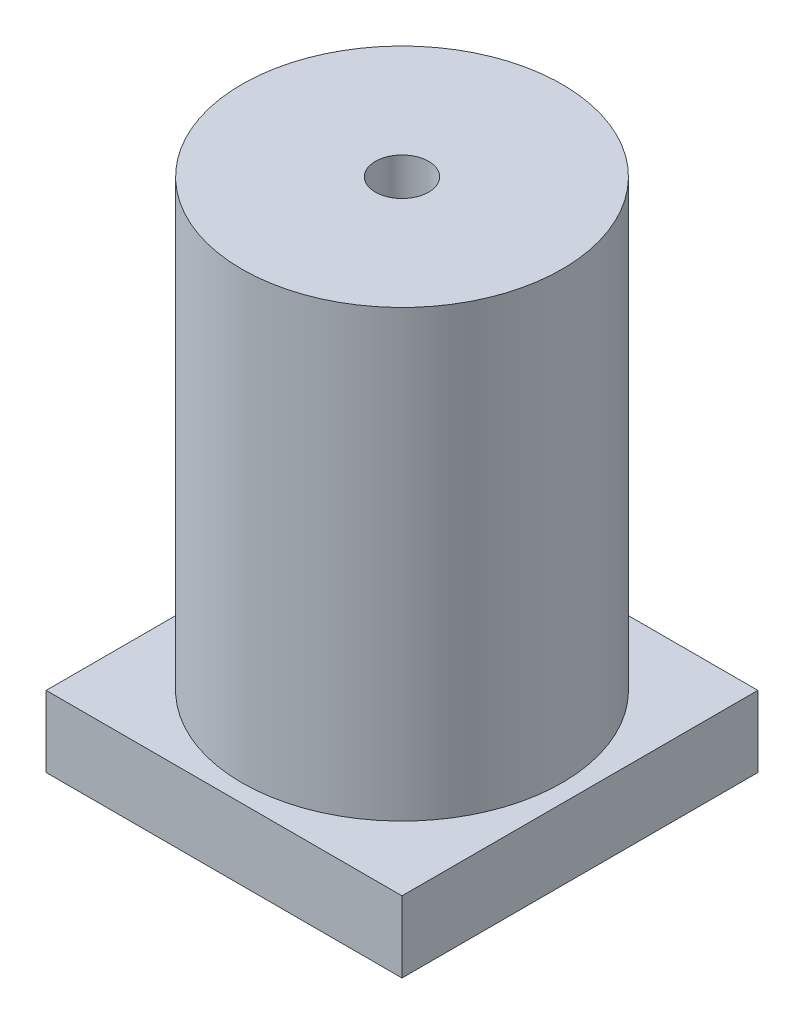
ISO-10303-21;
HEADER;
FILE_DESCRIPTION(('STEP AP214'),'2;1');
FILE_NAME('part.step','',(''),(''),'','','');
FILE_SCHEMA(('AUTOMOTIVE_DESIGN { 1 0 10303 214 1 1 1 1 }'));
ENDSEC;
DATA;
#1=APPLICATION_CONTEXT('core data for automotive mechanical design processes');
#2=APPLICATION_PROTOCOL_DEFINITION('international standard','automotive_design',2000,#1);
#3=PRODUCT_CONTEXT('',#1,'mechanical');
#4=PRODUCT('Part','Part','',(#3));
#5=PRODUCT_RELATED_PRODUCT_CATEGORY('part','',(#4));
#6=PRODUCT_DEFINITION_FORMATION('','',#4);
#7=PRODUCT_DEFINITION_CONTEXT('part definition',#1,'design');
#8=PRODUCT_DEFINITION('design','',#6,#7);
#9=PRODUCT_DEFINITION_SHAPE('','',#8);
#10=(LENGTH_UNIT() NAMED_UNIT(*) SI_UNIT(.MILLI.,.METRE.));
#11=(NAMED_UNIT(*) PLANE_ANGLE_UNIT() SI_UNIT($,.RADIAN.));
#12=(NAMED_UNIT(*) SI_UNIT($,.STERADIAN.) SOLID_ANGLE_UNIT());
#13=UNCERTAINTY_MEASURE_WITH_UNIT(LENGTH_MEASURE(1.E-05),#10,'distance_accuracy_value','');
#14=(GEOMETRIC_REPRESENTATION_CONTEXT(3) GLOBAL_UNCERTAINTY_ASSIGNED_CONTEXT((#13)) GLOBAL_UNIT_ASSIGNED_CONTEXT((#10,
#11,#12)) REPRESENTATION_CONTEXT('',''));
#15=CARTESIAN_POINT('',(0.,0.,0.));
#16=DIRECTION('',(0.,0.,1.));
#17=DIRECTION('',(1.,0.,0.));
#18=AXIS2_PLACEMENT_3D('',#15,#16,#17);
#19=CARTESIAN_POINT('',(100.,40.,100.));
#20=DIRECTION('',(-1.,0.,0.));
#21=DIRECTION('',(0.,0.,1.));
#22=AXIS2_PLACEMENT_3D('',#19,#20,#21);
#23=PLANE('',#22);
#24=DIRECTION('',(0.,0.,-1.));
#25=VECTOR('',#24,1.);
#26=CARTESIAN_POINT('',(100.,0.,100.));
#27=LINE('',#26,#25);
#28=CARTESIAN_POINT('',(100.,0.,100.));
#29=VERTEX_POINT('',#28);
#30=CARTESIAN_POINT('',(100.,0.,-100.));
#31=VERTEX_POINT('',#30);
#32=EDGE_CURVE('E111',#29,#31,#27,.T.);
#33=ORIENTED_EDGE('',*,*,#32,.T.);
#34=DIRECTION('',(0.,-1.,0.));
#35=VECTOR('',#34,1.);
#36=CARTESIAN_POINT('',(100.,40.,-100.));
#37=LINE('',#36,#35);
#38=CARTESIAN_POINT('',(100.,40.,-100.));
#39=VERTEX_POINT('',#38);
#40=EDGE_CURVE('E48',#39,#31,#37,.T.);
#41=ORIENTED_EDGE('',*,*,#40,.F.);
#42=DIRECTION('',(0.,0.,-1.));
#43=VECTOR('',#42,1.);
#44=CARTESIAN_POINT('',(100.,40.,100.));
#45=LINE('',#44,#43);
#46=CARTESIAN_POINT('',(100.,40.,100.));
#47=VERTEX_POINT('',#46);
#48=EDGE_CURVE('E98',#47,#39,#45,.T.);
#49=ORIENTED_EDGE('',*,*,#48,.F.);
#50=DIRECTION('',(0.,-1.,0.));
#51=VECTOR('',#50,1.);
#52=CARTESIAN_POINT('',(100.,40.,100.));
#53=LINE('',#52,#51);
#54=EDGE_CURVE('E107',#47,#29,#53,.T.);
#55=ORIENTED_EDGE('',*,*,#54,.T.);
#56=EDGE_LOOP('',(#33,#41,#49,#55));
#57=FACE_BOUND('',#56,.T.);
#58=ADVANCED_FACE('F45',(#57),#23,.F.);
#59=CARTESIAN_POINT('',(-100.,40.,-100.));
#60=DIRECTION('',(0.,0.,1.));
#61=DIRECTION('',(1.,0.,0.));
#62=AXIS2_PLACEMENT_3D('',#59,#60,#61);
#63=PLANE('',#62);
#64=DIRECTION('',(-1.,0.,0.));
#65=VECTOR('',#64,1.);
#66=CARTESIAN_POINT('',(-100.,0.,-100.));
#67=LINE('',#66,#65);
#68=CARTESIAN_POINT('',(-100.,0.,-100.));
#69=VERTEX_POINT('',#68);
#70=EDGE_CURVE('E103',#31,#69,#67,.T.);
#71=ORIENTED_EDGE('',*,*,#70,.T.);
#72=DIRECTION('',(0.,-1.,0.));
#73=VECTOR('',#72,1.);
#74=CARTESIAN_POINT('',(-100.,40.,-100.));
#75=LINE('',#74,#73);
#76=CARTESIAN_POINT('',(-100.,40.,-100.));
#77=VERTEX_POINT('',#76);
#78=EDGE_CURVE('E101',#77,#69,#75,.T.);
#79=ORIENTED_EDGE('',*,*,#78,.F.);
#80=DIRECTION('',(-1.,0.,0.));
#81=VECTOR('',#80,1.);
#82=CARTESIAN_POINT('',(-100.,40.,-100.));
#83=LINE('',#82,#81);
#84=EDGE_CURVE('E93',#39,#77,#83,.T.);
#85=ORIENTED_EDGE('',*,*,#84,.F.);
#86=ORIENTED_EDGE('',*,*,#40,.T.);
#87=EDGE_LOOP('',(#71,#79,#85,#86));
#88=FACE_BOUND('',#87,.T.);
#89=ADVANCED_FACE('F102',(#88),#63,.F.);
#90=CARTESIAN_POINT('',(-100.,40.,100.));
#91=DIRECTION('',(1.,0.,0.));
#92=DIRECTION('',(0.,0.,-1.));
#93=AXIS2_PLACEMENT_3D('',#90,#91,#92);
#94=PLANE('',#93);
#95=DIRECTION('',(0.,0.,1.));
#96=VECTOR('',#95,1.);
#97=CARTESIAN_POINT('',(-100.,0.,100.));
#98=LINE('',#97,#96);
#99=CARTESIAN_POINT('',(-100.,0.,100.));
#100=VERTEX_POINT('',#99);
#101=EDGE_CURVE('E79',#69,#100,#98,.T.);
#102=ORIENTED_EDGE('',*,*,#101,.T.);
#103=DIRECTION('',(0.,-1.,0.));
#104=VECTOR('',#103,1.);
#105=CARTESIAN_POINT('',(-100.,40.,100.));
#106=LINE('',#105,#104);
#107=CARTESIAN_POINT('',(-100.,40.,100.));
#108=VERTEX_POINT('',#107);
#109=EDGE_CURVE('E104',#108,#100,#106,.T.);
#110=ORIENTED_EDGE('',*,*,#109,.F.);
#111=DIRECTION('',(0.,0.,1.));
#112=VECTOR('',#111,1.);
#113=CARTESIAN_POINT('',(-100.,40.,100.));
#114=LINE('',#113,#112);
#115=EDGE_CURVE('E96',#77,#108,#114,.T.);
#116=ORIENTED_EDGE('',*,*,#115,.F.);
#117=ORIENTED_EDGE('',*,*,#78,.T.);
#118=EDGE_LOOP('',(#102,#110,#116,#117));
#119=FACE_BOUND('',#118,.T.);
#120=ADVANCED_FACE('F105',(#119),#94,.F.);
#121=CARTESIAN_POINT('',(-100.,40.,100.));
#122=DIRECTION('',(0.,0.,-1.));
#123=DIRECTION('',(-1.,0.,0.));
#124=AXIS2_PLACEMENT_3D('',#121,#122,#123);
#125=PLANE('',#124);
#126=DIRECTION('',(1.,0.,0.));
#127=VECTOR('',#126,1.);
#128=CARTESIAN_POINT('',(-100.,0.,100.));
#129=LINE('',#128,#127);
#130=EDGE_CURVE('E85',#100,#29,#129,.T.);
#131=ORIENTED_EDGE('',*,*,#130,.T.);
#132=ORIENTED_EDGE('',*,*,#54,.F.);
#133=DIRECTION('',(1.,0.,0.));
#134=VECTOR('',#133,1.);
#135=CARTESIAN_POINT('',(-100.,40.,100.));
#136=LINE('',#135,#134);
#137=EDGE_CURVE('E62',#108,#47,#136,.T.);
#138=ORIENTED_EDGE('',*,*,#137,.F.);
#139=ORIENTED_EDGE('',*,*,#109,.T.);
#140=EDGE_LOOP('',(#131,#132,#138,#139));
#141=FACE_BOUND('',#140,.T.);
#142=ADVANCED_FACE('F119',(#141),#125,.F.);
#143=CARTESIAN_POINT('',(0.,40.,0.));
#144=DIRECTION('',(0.,-1.,0.));
#145=DIRECTION('',(0.,0.,-1.));
#146=AXIS2_PLACEMENT_3D('',#143,#144,#145);
#147=PLANE('',#146);
#148=CARTESIAN_POINT('',(0.,40.,0.));
#149=DIRECTION('',(0.,1.,0.));
#150=DIRECTION('',(0.,0.,1.));
#151=AXIS2_PLACEMENT_3D('',#148,#149,#150);
#152=CIRCLE('',#151,90.);
#153=CARTESIAN_POINT('',(0.,40.,90.));
#154=VERTEX_POINT('',#153);
#155=EDGE_CURVE('E11',#154,#154,#152,.T.);
#156=ORIENTED_EDGE('',*,*,#155,.F.);
#157=EDGE_LOOP('',(#156));
#158=FACE_BOUND('',#157,.T.);
#159=ORIENTED_EDGE('',*,*,#48,.T.);
#160=ORIENTED_EDGE('',*,*,#84,.T.);
#161=ORIENTED_EDGE('',*,*,#115,.T.);
#162=ORIENTED_EDGE('',*,*,#137,.T.);
#163=EDGE_LOOP('',(#159,#160,#161,#162));
#164=FACE_BOUND('',#163,.T.);
#165=ADVANCED_FACE('F94',(#158,#164),#147,.F.);
#166=CARTESIAN_POINT('',(0.,0.,0.));
#167=DIRECTION('',(0.,-1.,0.));
#168=DIRECTION('',(0.,0.,-1.));
#169=AXIS2_PLACEMENT_3D('',#166,#167,#168);
#170=PLANE('',#169);
#171=ORIENTED_EDGE('',*,*,#32,.F.);
#172=ORIENTED_EDGE('',*,*,#130,.F.);
#173=ORIENTED_EDGE('',*,*,#101,.F.);
#174=ORIENTED_EDGE('',*,*,#70,.F.);
#175=EDGE_LOOP('',(#171,#172,#173,#174));
#176=FACE_BOUND('',#175,.T.);
#177=ADVANCED_FACE('F122',(#176),#170,.T.);
#178=CARTESIAN_POINT('',(0.,290.,0.));
#179=DIRECTION('',(0.,-1.,0.));
#180=DIRECTION('',(0.,0.,-1.));
#181=AXIS2_PLACEMENT_3D('',#178,#179,#180);
#182=CYLINDRICAL_SURFACE('',#181,90.);
#183=CARTESIAN_POINT('',(0.,290.,0.));
#184=DIRECTION('',(0.,1.,0.));
#185=DIRECTION('',(0.,0.,1.));
#186=AXIS2_PLACEMENT_3D('',#183,#184,#185);
#187=CIRCLE('',#186,90.);
#188=CARTESIAN_POINT('',(0.,290.,90.));
#189=VERTEX_POINT('',#188);
#190=EDGE_CURVE('E114',#189,#189,#187,.T.);
#191=ORIENTED_EDGE('',*,*,#190,.F.);
#192=EDGE_LOOP('',(#191));
#193=FACE_BOUND('',#192,.T.);
#194=ORIENTED_EDGE('',*,*,#155,.T.);
#195=EDGE_LOOP('',(#194));
#196=FACE_BOUND('',#195,.T.);
#197=ADVANCED_FACE('F145',(#193,#196),#182,.T.);
#198=CARTESIAN_POINT('',(0.,290.,0.));
#199=DIRECTION('',(0.,1.,0.));
#200=DIRECTION('',(0.,0.,1.));
#201=AXIS2_PLACEMENT_3D('',#198,#199,#200);
#202=PLANE('',#201);
#203=CARTESIAN_POINT('',(0.,290.,0.));
#204=DIRECTION('',(0.,1.,0.));
#205=DIRECTION('',(0.,0.,1.));
#206=AXIS2_PLACEMENT_3D('',#203,#204,#205);
#207=CIRCLE('',#206,15.);
#208=CARTESIAN_POINT('',(0.,290.,15.));
#209=VERTEX_POINT('',#208);
#210=EDGE_CURVE('E128',#209,#209,#207,.T.);
#211=ORIENTED_EDGE('',*,*,#210,.F.);
#212=EDGE_LOOP('',(#211));
#213=FACE_BOUND('',#212,.T.);
#214=ORIENTED_EDGE('',*,*,#190,.T.);
#215=EDGE_LOOP('',(#214));
#216=FACE_BOUND('',#215,.T.);
#217=ADVANCED_FACE('F139',(#213,#216),#202,.T.);
#218=CARTESIAN_POINT('',(0.,265.,0.));
#219=DIRECTION('',(0.,1.,0.));
#220=DIRECTION('',(0.,0.,1.));
#221=AXIS2_PLACEMENT_3D('',#218,#219,#220);
#222=CYLINDRICAL_SURFACE('',#221,15.);
#223=CARTESIAN_POINT('',(0.,265.,0.));
#224=DIRECTION('',(0.,1.,0.));
#225=DIRECTION('',(0.,0.,1.));
#226=AXIS2_PLACEMENT_3D('',#223,#224,#225);
#227=CIRCLE('',#226,15.);
#228=CARTESIAN_POINT('',(0.,265.,15.));
#229=VERTEX_POINT('',#228);
#230=EDGE_CURVE('E127',#229,#229,#227,.T.);
#231=ORIENTED_EDGE('',*,*,#230,.F.);
#232=EDGE_LOOP('',(#231));
#233=FACE_BOUND('',#232,.T.);
#234=ORIENTED_EDGE('',*,*,#210,.T.);
#235=EDGE_LOOP('',(#234));
#236=FACE_BOUND('',#235,.T.);
#237=ADVANCED_FACE('F136',(#233,#236),#222,.F.);
#238=CARTESIAN_POINT('',(0.,265.,0.));
#239=DIRECTION('',(0.,1.,0.));
#240=DIRECTION('',(0.,0.,1.));
#241=AXIS2_PLACEMENT_3D('',#238,#239,#240);
#242=PLANE('',#241);
#243=ORIENTED_EDGE('',*,*,#230,.T.);
#244=EDGE_LOOP('',(#243));
#245=FACE_BOUND('',#244,.T.);
#246=ADVANCED_FACE('F134',(#245),#242,.T.);
#247=CLOSED_SHELL('',(#58,#89,#120,#142,#165,#177,#197,#217,#237,#246));
#248=MANIFOLD_SOLID_BREP('B2',#247);
#249=ADVANCED_BREP_SHAPE_REPRESENTATION('',(#18,#248),#14);
#250=SHAPE_DEFINITION_REPRESENTATION(#9,#249);
ENDSEC;
END-ISO-10303-21;
